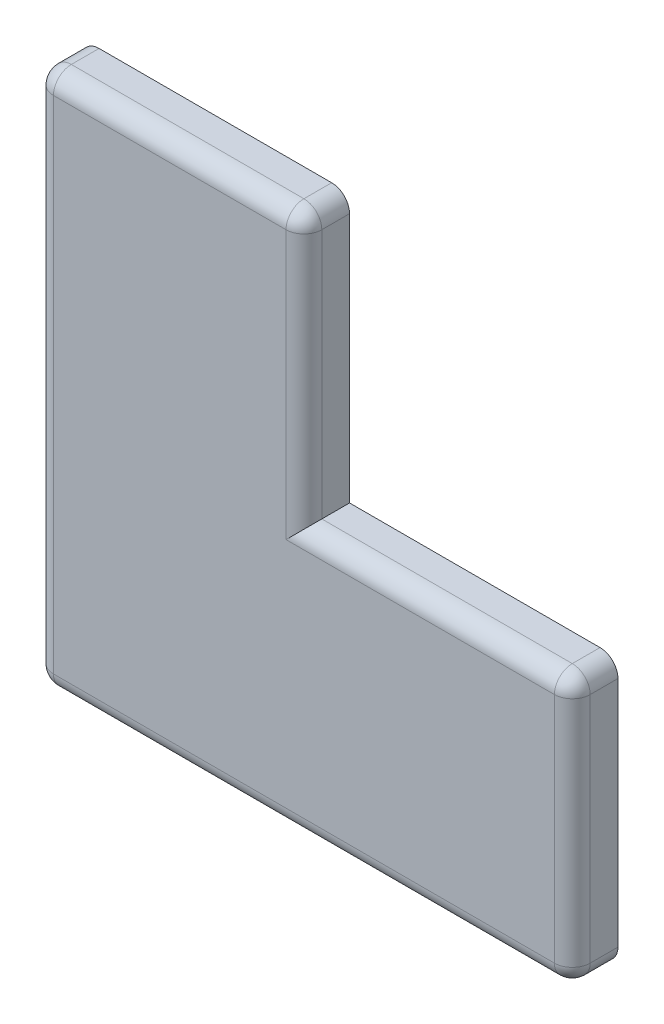
ISO-10303-21;
HEADER;
FILE_DESCRIPTION(('STEP AP214'),'2;1');
FILE_NAME('part.step','',(''),(''),'','','');
FILE_SCHEMA(('AUTOMOTIVE_DESIGN { 1 0 10303 214 1 1 1 1 }'));
ENDSEC;
DATA;
#1=APPLICATION_CONTEXT('core data for automotive mechanical design processes');
#2=APPLICATION_PROTOCOL_DEFINITION('international standard','automotive_design',2000,#1);
#3=PRODUCT_CONTEXT('',#1,'mechanical');
#4=PRODUCT('Part','Part','',(#3));
#5=PRODUCT_RELATED_PRODUCT_CATEGORY('part','',(#4));
#6=PRODUCT_DEFINITION_FORMATION('','',#4);
#7=PRODUCT_DEFINITION_CONTEXT('part definition',#1,'design');
#8=PRODUCT_DEFINITION('design','',#6,#7);
#9=PRODUCT_DEFINITION_SHAPE('','',#8);
#10=(LENGTH_UNIT() NAMED_UNIT(*) SI_UNIT(.MILLI.,.METRE.));
#11=(NAMED_UNIT(*) PLANE_ANGLE_UNIT() SI_UNIT($,.RADIAN.));
#12=(NAMED_UNIT(*) SI_UNIT($,.STERADIAN.) SOLID_ANGLE_UNIT());
#13=UNCERTAINTY_MEASURE_WITH_UNIT(LENGTH_MEASURE(1.E-05),#10,'distance_accuracy_value','');
#14=(GEOMETRIC_REPRESENTATION_CONTEXT(3) GLOBAL_UNCERTAINTY_ASSIGNED_CONTEXT((#13)) GLOBAL_UNIT_ASSIGNED_CONTEXT((#10,
#11,#12)) REPRESENTATION_CONTEXT('',''));
#15=CARTESIAN_POINT('',(0.,0.,0.));
#16=DIRECTION('',(0.,0.,1.));
#17=DIRECTION('',(1.,0.,0.));
#18=AXIS2_PLACEMENT_3D('',#15,#16,#17);
#19=CARTESIAN_POINT('',(0.,0.,5.1));
#20=DIRECTION('',(0.,1.,0.));
#21=DIRECTION('',(0.,0.,1.));
#22=AXIS2_PLACEMENT_3D('',#19,#20,#21);
#23=PLANE('',#22);
#24=DIRECTION('',(1.,0.,0.));
#25=VECTOR('',#24,1.);
#26=CARTESIAN_POINT('',(0.,0.,3.1));
#27=LINE('',#26,#25);
#28=CARTESIAN_POINT('',(58.,0.,3.1));
#29=VERTEX_POINT('',#28);
#30=CARTESIAN_POINT('',(2.,0.,3.1));
#31=VERTEX_POINT('',#30);
#32=EDGE_CURVE('E33',#29,#31,#27,.F.);
#33=ORIENTED_EDGE('',*,*,#32,.T.);
#34=DIRECTION('',(0.,0.,-1.));
#35=VECTOR('',#34,1.);
#36=CARTESIAN_POINT('',(2.,0.,5.1));
#37=LINE('',#36,#35);
#38=CARTESIAN_POINT('',(2.,0.,0.));
#39=VERTEX_POINT('',#38);
#40=EDGE_CURVE('E286',#31,#39,#37,.T.);
#41=ORIENTED_EDGE('',*,*,#40,.T.);
#42=DIRECTION('',(1.,0.,0.));
#43=VECTOR('',#42,1.);
#44=CARTESIAN_POINT('',(0.,0.,0.));
#45=LINE('',#44,#43);
#46=CARTESIAN_POINT('',(58.,0.,0.));
#47=VERTEX_POINT('',#46);
#48=EDGE_CURVE('E209',#39,#47,#45,.T.);
#49=ORIENTED_EDGE('',*,*,#48,.T.);
#50=DIRECTION('',(0.,0.,-1.));
#51=VECTOR('',#50,1.);
#52=CARTESIAN_POINT('',(58.,0.,5.1));
#53=LINE('',#52,#51);
#54=EDGE_CURVE('E38',#47,#29,#53,.F.);
#55=ORIENTED_EDGE('',*,*,#54,.T.);
#56=EDGE_LOOP('',(#33,#41,#49,#55));
#57=FACE_BOUND('',#56,.T.);
#58=ADVANCED_FACE('F16',(#57),#23,.F.);
#59=CARTESIAN_POINT('',(60.,0.,5.1));
#60=DIRECTION('',(-1.,0.,0.));
#61=DIRECTION('',(0.,0.,1.));
#62=AXIS2_PLACEMENT_3D('',#59,#60,#61);
#63=PLANE('',#62);
#64=DIRECTION('',(0.,1.,0.));
#65=VECTOR('',#64,1.);
#66=CARTESIAN_POINT('',(60.,0.,3.1));
#67=LINE('',#66,#65);
#68=CARTESIAN_POINT('',(60.,28.,3.1));
#69=VERTEX_POINT('',#68);
#70=CARTESIAN_POINT('',(60.,2.,3.1));
#71=VERTEX_POINT('',#70);
#72=EDGE_CURVE('E280',#69,#71,#67,.F.);
#73=ORIENTED_EDGE('',*,*,#72,.T.);
#74=DIRECTION('',(0.,0.,-1.));
#75=VECTOR('',#74,1.);
#76=CARTESIAN_POINT('',(60.,2.,5.1));
#77=LINE('',#76,#75);
#78=CARTESIAN_POINT('',(60.,2.,0.));
#79=VERTEX_POINT('',#78);
#80=EDGE_CURVE('E282',#71,#79,#77,.T.);
#81=ORIENTED_EDGE('',*,*,#80,.T.);
#82=DIRECTION('',(0.,1.,0.));
#83=VECTOR('',#82,1.);
#84=CARTESIAN_POINT('',(60.,0.,0.));
#85=LINE('',#84,#83);
#86=CARTESIAN_POINT('',(60.,28.,0.));
#87=VERTEX_POINT('',#86);
#88=EDGE_CURVE('E218',#79,#87,#85,.T.);
#89=ORIENTED_EDGE('',*,*,#88,.T.);
#90=DIRECTION('',(0.,0.,-1.));
#91=VECTOR('',#90,1.);
#92=CARTESIAN_POINT('',(60.,28.,5.1));
#93=LINE('',#92,#91);
#94=EDGE_CURVE('E278',#87,#69,#93,.F.);
#95=ORIENTED_EDGE('',*,*,#94,.T.);
#96=EDGE_LOOP('',(#73,#81,#89,#95));
#97=FACE_BOUND('',#96,.T.);
#98=ADVANCED_FACE('F399',(#97),#63,.F.);
#99=CARTESIAN_POINT('',(60.,30.,5.1));
#100=DIRECTION('',(0.,-1.,0.));
#101=DIRECTION('',(1.,0.,0.));
#102=AXIS2_PLACEMENT_3D('',#99,#100,#101);
#103=PLANE('',#102);
#104=DIRECTION('',(0.,0.,-1.));
#105=VECTOR('',#104,1.);
#106=CARTESIAN_POINT('',(30.,30.,5.1));
#107=LINE('',#106,#105);
#108=CARTESIAN_POINT('',(30.,30.,3.1));
#109=VERTEX_POINT('',#108);
#110=CARTESIAN_POINT('',(30.,30.,0.));
#111=VERTEX_POINT('',#110);
#112=EDGE_CURVE('E232',#109,#111,#107,.T.);
#113=ORIENTED_EDGE('',*,*,#112,.F.);
#114=DIRECTION('',(-1.,0.,0.));
#115=VECTOR('',#114,1.);
#116=CARTESIAN_POINT('',(60.,30.,3.1));
#117=LINE('',#116,#115);
#118=CARTESIAN_POINT('',(58.,30.,3.1));
#119=VERTEX_POINT('',#118);
#120=EDGE_CURVE('E276',#109,#119,#117,.F.);
#121=ORIENTED_EDGE('',*,*,#120,.T.);
#122=DIRECTION('',(0.,0.,-1.));
#123=VECTOR('',#122,1.);
#124=CARTESIAN_POINT('',(58.,30.,5.1));
#125=LINE('',#124,#123);
#126=CARTESIAN_POINT('',(58.,30.,0.));
#127=VERTEX_POINT('',#126);
#128=EDGE_CURVE('E274',#119,#127,#125,.T.);
#129=ORIENTED_EDGE('',*,*,#128,.T.);
#130=DIRECTION('',(-1.,0.,0.));
#131=VECTOR('',#130,1.);
#132=CARTESIAN_POINT('',(60.,30.,0.));
#133=LINE('',#132,#131);
#134=EDGE_CURVE('E221',#127,#111,#133,.T.);
#135=ORIENTED_EDGE('',*,*,#134,.T.);
#136=EDGE_LOOP('',(#113,#121,#129,#135));
#137=FACE_BOUND('',#136,.T.);
#138=ADVANCED_FACE('F404',(#137),#103,.F.);
#139=CARTESIAN_POINT('',(30.,30.,5.1));
#140=DIRECTION('',(-1.,0.,0.));
#141=DIRECTION('',(0.,0.,1.));
#142=AXIS2_PLACEMENT_3D('',#139,#140,#141);
#143=PLANE('',#142);
#144=DIRECTION('',(0.,0.,-1.));
#145=VECTOR('',#144,1.);
#146=CARTESIAN_POINT('',(30.,58.,5.1));
#147=LINE('',#146,#145);
#148=CARTESIAN_POINT('',(30.,58.,0.));
#149=VERTEX_POINT('',#148);
#150=CARTESIAN_POINT('',(30.,58.,3.1));
#151=VERTEX_POINT('',#150);
#152=EDGE_CURVE('E270',#149,#151,#147,.F.);
#153=ORIENTED_EDGE('',*,*,#152,.T.);
#154=DIRECTION('',(0.,1.,0.));
#155=VECTOR('',#154,1.);
#156=CARTESIAN_POINT('',(30.,30.,3.1));
#157=LINE('',#156,#155);
#158=EDGE_CURVE('E272',#151,#109,#157,.F.);
#159=ORIENTED_EDGE('',*,*,#158,.T.);
#160=ORIENTED_EDGE('',*,*,#112,.T.);
#161=DIRECTION('',(0.,1.,0.));
#162=VECTOR('',#161,1.);
#163=CARTESIAN_POINT('',(30.,30.,0.));
#164=LINE('',#163,#162);
#165=EDGE_CURVE('E223',#111,#149,#164,.T.);
#166=ORIENTED_EDGE('',*,*,#165,.T.);
#167=EDGE_LOOP('',(#153,#159,#160,#166));
#168=FACE_BOUND('',#167,.T.);
#169=ADVANCED_FACE('F514',(#168),#143,.F.);
#170=CARTESIAN_POINT('',(30.,60.,5.1));
#171=DIRECTION('',(0.,-1.,0.));
#172=DIRECTION('',(1.,0.,0.));
#173=AXIS2_PLACEMENT_3D('',#170,#171,#172);
#174=PLANE('',#173);
#175=DIRECTION('',(-1.,0.,0.));
#176=VECTOR('',#175,1.);
#177=CARTESIAN_POINT('',(30.,60.,0.));
#178=LINE('',#177,#176);
#179=CARTESIAN_POINT('',(28.,60.,0.));
#180=VERTEX_POINT('',#179);
#181=CARTESIAN_POINT('',(2.,60.,0.));
#182=VERTEX_POINT('',#181);
#183=EDGE_CURVE('E226',#180,#182,#178,.T.);
#184=ORIENTED_EDGE('',*,*,#183,.T.);
#185=DIRECTION('',(0.,0.,-1.));
#186=VECTOR('',#185,1.);
#187=CARTESIAN_POINT('',(2.,60.,5.1));
#188=LINE('',#187,#186);
#189=CARTESIAN_POINT('',(2.,60.,3.1));
#190=VERTEX_POINT('',#189);
#191=EDGE_CURVE('E268',#182,#190,#188,.F.);
#192=ORIENTED_EDGE('',*,*,#191,.T.);
#193=DIRECTION('',(-1.,0.,0.));
#194=VECTOR('',#193,1.);
#195=CARTESIAN_POINT('',(30.,60.,3.1));
#196=LINE('',#195,#194);
#197=CARTESIAN_POINT('',(28.,60.,3.1));
#198=VERTEX_POINT('',#197);
#199=EDGE_CURVE('E266',#190,#198,#196,.F.);
#200=ORIENTED_EDGE('',*,*,#199,.T.);
#201=DIRECTION('',(0.,0.,-1.));
#202=VECTOR('',#201,1.);
#203=CARTESIAN_POINT('',(28.,60.,5.1));
#204=LINE('',#203,#202);
#205=EDGE_CURVE('E264',#198,#180,#204,.T.);
#206=ORIENTED_EDGE('',*,*,#205,.T.);
#207=EDGE_LOOP('',(#184,#192,#200,#206));
#208=FACE_BOUND('',#207,.T.);
#209=ADVANCED_FACE('F503',(#208),#174,.F.);
#210=CARTESIAN_POINT('',(0.,0.,5.1));
#211=DIRECTION('',(1.,0.,0.));
#212=DIRECTION('',(0.,0.,-1.));
#213=AXIS2_PLACEMENT_3D('',#210,#211,#212);
#214=PLANE('',#213);
#215=DIRECTION('',(0.,-1.,0.));
#216=VECTOR('',#215,1.);
#217=CARTESIAN_POINT('',(0.,0.,0.));
#218=LINE('',#217,#216);
#219=CARTESIAN_POINT('',(0.,58.,0.));
#220=VERTEX_POINT('',#219);
#221=CARTESIAN_POINT('',(0.,2.,0.));
#222=VERTEX_POINT('',#221);
#223=EDGE_CURVE('E229',#220,#222,#218,.T.);
#224=ORIENTED_EDGE('',*,*,#223,.T.);
#225=DIRECTION('',(0.,0.,-1.));
#226=VECTOR('',#225,1.);
#227=CARTESIAN_POINT('',(0.,2.,5.1));
#228=LINE('',#227,#226);
#229=CARTESIAN_POINT('',(0.,2.,3.1));
#230=VERTEX_POINT('',#229);
#231=EDGE_CURVE('E262',#222,#230,#228,.F.);
#232=ORIENTED_EDGE('',*,*,#231,.T.);
#233=DIRECTION('',(0.,-1.,0.));
#234=VECTOR('',#233,1.);
#235=CARTESIAN_POINT('',(0.,60.,3.1));
#236=LINE('',#235,#234);
#237=CARTESIAN_POINT('',(0.,58.,3.1));
#238=VERTEX_POINT('',#237);
#239=EDGE_CURVE('E259',#230,#238,#236,.F.);
#240=ORIENTED_EDGE('',*,*,#239,.T.);
#241=DIRECTION('',(0.,0.,-1.));
#242=VECTOR('',#241,1.);
#243=CARTESIAN_POINT('',(0.,58.,5.1));
#244=LINE('',#243,#242);
#245=EDGE_CURVE('E257',#238,#220,#244,.T.);
#246=ORIENTED_EDGE('',*,*,#245,.T.);
#247=EDGE_LOOP('',(#224,#232,#240,#246));
#248=FACE_BOUND('',#247,.T.);
#249=ADVANCED_FACE('F491',(#248),#214,.F.);
#250=CARTESIAN_POINT('',(0.,0.,5.1));
#251=DIRECTION('',(0.,0.,1.));
#252=DIRECTION('',(1.,0.,0.));
#253=AXIS2_PLACEMENT_3D('',#250,#251,#252);
#254=PLANE('',#253);
#255=DIRECTION('',(-1.,0.,0.));
#256=VECTOR('',#255,1.);
#257=CARTESIAN_POINT('',(0.,58.,5.1));
#258=LINE('',#257,#256);
#259=CARTESIAN_POINT('',(28.,58.,5.1));
#260=VERTEX_POINT('',#259);
#261=CARTESIAN_POINT('',(2.,58.,5.1));
#262=VERTEX_POINT('',#261);
#263=EDGE_CURVE('E252',#260,#262,#258,.T.);
#264=ORIENTED_EDGE('',*,*,#263,.T.);
#265=DIRECTION('',(0.,-1.,0.));
#266=VECTOR('',#265,1.);
#267=CARTESIAN_POINT('',(2.,0.,5.1));
#268=LINE('',#267,#266);
#269=CARTESIAN_POINT('',(2.,2.,5.1));
#270=VERTEX_POINT('',#269);
#271=EDGE_CURVE('E254',#262,#270,#268,.T.);
#272=ORIENTED_EDGE('',*,*,#271,.T.);
#273=DIRECTION('',(1.,0.,0.));
#274=VECTOR('',#273,1.);
#275=CARTESIAN_POINT('',(60.,2.,5.1));
#276=LINE('',#275,#274);
#277=CARTESIAN_POINT('',(58.,2.,5.1));
#278=VERTEX_POINT('',#277);
#279=EDGE_CURVE('E244',#270,#278,#276,.T.);
#280=ORIENTED_EDGE('',*,*,#279,.T.);
#281=DIRECTION('',(0.,1.,0.));
#282=VECTOR('',#281,1.);
#283=CARTESIAN_POINT('',(58.,30.,5.1));
#284=LINE('',#283,#282);
#285=CARTESIAN_POINT('',(58.,28.,5.1));
#286=VERTEX_POINT('',#285);
#287=EDGE_CURVE('E246',#278,#286,#284,.T.);
#288=ORIENTED_EDGE('',*,*,#287,.T.);
#289=DIRECTION('',(-1.,0.,0.));
#290=VECTOR('',#289,1.);
#291=CARTESIAN_POINT('',(30.,28.,5.1));
#292=LINE('',#291,#290);
#293=CARTESIAN_POINT('',(28.,28.,5.1));
#294=VERTEX_POINT('',#293);
#295=EDGE_CURVE('E248',#286,#294,#292,.T.);
#296=ORIENTED_EDGE('',*,*,#295,.T.);
#297=DIRECTION('',(0.,1.,0.));
#298=VECTOR('',#297,1.);
#299=CARTESIAN_POINT('',(28.,60.,5.1));
#300=LINE('',#299,#298);
#301=EDGE_CURVE('E250',#294,#260,#300,.T.);
#302=ORIENTED_EDGE('',*,*,#301,.T.);
#303=EDGE_LOOP('',(#264,#272,#280,#288,#296,#302));
#304=FACE_BOUND('',#303,.T.);
#305=ADVANCED_FACE('F475',(#304),#254,.T.);
#306=CARTESIAN_POINT('',(0.,0.,0.));
#307=DIRECTION('',(0.,0.,1.));
#308=DIRECTION('',(1.,0.,0.));
#309=AXIS2_PLACEMENT_3D('',#306,#307,#308);
#310=PLANE('',#309);
#311=DIRECTION('',(-1.,0.,0.));
#312=VECTOR('',#311,1.);
#313=CARTESIAN_POINT('',(58.,2.,0.));
#314=LINE('',#313,#312);
#315=CARTESIAN_POINT('',(58.,2.,0.));
#316=VERTEX_POINT('',#315);
#317=CARTESIAN_POINT('',(2.,2.,0.));
#318=VERTEX_POINT('',#317);
#319=EDGE_CURVE('E196',#316,#318,#314,.T.);
#320=ORIENTED_EDGE('',*,*,#319,.F.);
#321=DIRECTION('',(0.,-1.,0.));
#322=VECTOR('',#321,1.);
#323=CARTESIAN_POINT('',(58.,28.,0.));
#324=LINE('',#323,#322);
#325=CARTESIAN_POINT('',(58.,28.,0.));
#326=VERTEX_POINT('',#325);
#327=EDGE_CURVE('E161',#326,#316,#324,.T.);
#328=ORIENTED_EDGE('',*,*,#327,.F.);
#329=DIRECTION('',(1.,0.,0.));
#330=VECTOR('',#329,1.);
#331=CARTESIAN_POINT('',(28.,28.,0.));
#332=LINE('',#331,#330);
#333=CARTESIAN_POINT('',(28.,28.,0.));
#334=VERTEX_POINT('',#333);
#335=EDGE_CURVE('E179',#334,#326,#332,.T.);
#336=ORIENTED_EDGE('',*,*,#335,.F.);
#337=DIRECTION('',(0.,-1.,0.));
#338=VECTOR('',#337,1.);
#339=CARTESIAN_POINT('',(28.,58.,0.));
#340=LINE('',#339,#338);
#341=CARTESIAN_POINT('',(28.,58.,0.));
#342=VERTEX_POINT('',#341);
#343=EDGE_CURVE('E182',#342,#334,#340,.T.);
#344=ORIENTED_EDGE('',*,*,#343,.F.);
#345=DIRECTION('',(1.,0.,0.));
#346=VECTOR('',#345,1.);
#347=CARTESIAN_POINT('',(2.,58.,0.));
#348=LINE('',#347,#346);
#349=CARTESIAN_POINT('',(2.,58.,0.));
#350=VERTEX_POINT('',#349);
#351=EDGE_CURVE('E202',#350,#342,#348,.T.);
#352=ORIENTED_EDGE('',*,*,#351,.F.);
#353=DIRECTION('',(0.,1.,0.));
#354=VECTOR('',#353,1.);
#355=CARTESIAN_POINT('',(2.,2.,0.));
#356=LINE('',#355,#354);
#357=EDGE_CURVE('E199',#318,#350,#356,.T.);
#358=ORIENTED_EDGE('',*,*,#357,.F.);
#359=EDGE_LOOP('',(#320,#328,#336,#344,#352,#358));
#360=FACE_BOUND('',#359,.T.);
#361=ORIENTED_EDGE('',*,*,#48,.F.);
#362=CARTESIAN_POINT('',(2.,2.,0.));
#363=DIRECTION('',(0.,0.,1.));
#364=DIRECTION('',(1.,0.,0.));
#365=AXIS2_PLACEMENT_3D('',#362,#363,#364);
#366=CIRCLE('',#365,2.);
#367=EDGE_CURVE('E10',#39,#222,#366,.F.);
#368=ORIENTED_EDGE('',*,*,#367,.T.);
#369=ORIENTED_EDGE('',*,*,#223,.F.);
#370=CARTESIAN_POINT('',(2.,58.,0.));
#371=DIRECTION('',(0.,0.,1.));
#372=DIRECTION('',(1.,0.,0.));
#373=AXIS2_PLACEMENT_3D('',#370,#371,#372);
#374=CIRCLE('',#373,2.);
#375=EDGE_CURVE('E290',#220,#182,#374,.F.);
#376=ORIENTED_EDGE('',*,*,#375,.T.);
#377=ORIENTED_EDGE('',*,*,#183,.F.);
#378=CARTESIAN_POINT('',(28.,58.,0.));
#379=DIRECTION('',(0.,0.,1.));
#380=DIRECTION('',(1.,0.,0.));
#381=AXIS2_PLACEMENT_3D('',#378,#379,#380);
#382=CIRCLE('',#381,2.);
#383=EDGE_CURVE('E288',#180,#149,#382,.F.);
#384=ORIENTED_EDGE('',*,*,#383,.T.);
#385=ORIENTED_EDGE('',*,*,#165,.F.);
#386=ORIENTED_EDGE('',*,*,#134,.F.);
#387=CARTESIAN_POINT('',(58.,28.,0.));
#388=DIRECTION('',(0.,0.,1.));
#389=DIRECTION('',(1.,0.,0.));
#390=AXIS2_PLACEMENT_3D('',#387,#388,#389);
#391=CIRCLE('',#390,2.);
#392=EDGE_CURVE('E292',#127,#87,#391,.F.);
#393=ORIENTED_EDGE('',*,*,#392,.T.);
#394=ORIENTED_EDGE('',*,*,#88,.F.);
#395=CARTESIAN_POINT('',(58.,2.,0.));
#396=DIRECTION('',(0.,0.,1.));
#397=DIRECTION('',(1.,0.,0.));
#398=AXIS2_PLACEMENT_3D('',#395,#396,#397);
#399=CIRCLE('',#398,2.);
#400=EDGE_CURVE('E25',#79,#47,#399,.F.);
#401=ORIENTED_EDGE('',*,*,#400,.T.);
#402=EDGE_LOOP('',(#361,#368,#369,#376,#377,#384,#385,#386,#393,#394,#401));
#403=FACE_BOUND('',#402,.T.);
#404=ADVANCED_FACE('F497',(#360,#403),#310,.F.);
#405=CARTESIAN_POINT('',(58.,28.,1.75));
#406=DIRECTION('',(1.,0.,0.));
#407=DIRECTION('',(0.,0.,-1.));
#408=AXIS2_PLACEMENT_3D('',#405,#406,#407);
#409=PLANE('',#408);
#410=ORIENTED_EDGE('',*,*,#327,.T.);
#411=DIRECTION('',(0.,0.,-1.));
#412=VECTOR('',#411,1.);
#413=CARTESIAN_POINT('',(58.,2.,1.75));
#414=LINE('',#413,#412);
#415=CARTESIAN_POINT('',(58.,2.,1.75));
#416=VERTEX_POINT('',#415);
#417=EDGE_CURVE('E154',#416,#316,#414,.T.);
#418=ORIENTED_EDGE('',*,*,#417,.F.);
#419=DIRECTION('',(0.,-1.,0.));
#420=VECTOR('',#419,1.);
#421=CARTESIAN_POINT('',(58.,28.,1.75));
#422=LINE('',#421,#420);
#423=CARTESIAN_POINT('',(58.,28.,1.75));
#424=VERTEX_POINT('',#423);
#425=EDGE_CURVE('E158',#424,#416,#422,.T.);
#426=ORIENTED_EDGE('',*,*,#425,.F.);
#427=DIRECTION('',(0.,0.,-1.));
#428=VECTOR('',#427,1.);
#429=CARTESIAN_POINT('',(58.,28.,1.75));
#430=LINE('',#429,#428);
#431=EDGE_CURVE('E207',#424,#326,#430,.T.);
#432=ORIENTED_EDGE('',*,*,#431,.T.);
#433=EDGE_LOOP('',(#410,#418,#426,#432));
#434=FACE_BOUND('',#433,.T.);
#435=ADVANCED_FACE('F156',(#434),#409,.F.);
#436=CARTESIAN_POINT('',(28.,28.,1.75));
#437=DIRECTION('',(0.,1.,0.));
#438=DIRECTION('',(-1.,0.,0.));
#439=AXIS2_PLACEMENT_3D('',#436,#437,#438);
#440=PLANE('',#439);
#441=ORIENTED_EDGE('',*,*,#335,.T.);
#442=ORIENTED_EDGE('',*,*,#431,.F.);
#443=DIRECTION('',(1.,0.,0.));
#444=VECTOR('',#443,1.);
#445=CARTESIAN_POINT('',(28.,28.,1.75));
#446=LINE('',#445,#444);
#447=CARTESIAN_POINT('',(28.,28.,1.75));
#448=VERTEX_POINT('',#447);
#449=EDGE_CURVE('E166',#448,#424,#446,.T.);
#450=ORIENTED_EDGE('',*,*,#449,.F.);
#451=DIRECTION('',(0.,0.,-1.));
#452=VECTOR('',#451,1.);
#453=CARTESIAN_POINT('',(28.,28.,1.75));
#454=LINE('',#453,#452);
#455=EDGE_CURVE('E210',#448,#334,#454,.T.);
#456=ORIENTED_EDGE('',*,*,#455,.T.);
#457=EDGE_LOOP('',(#441,#442,#450,#456));
#458=FACE_BOUND('',#457,.T.);
#459=ADVANCED_FACE('F540',(#458),#440,.F.);
#460=CARTESIAN_POINT('',(28.,58.,1.75));
#461=DIRECTION('',(1.,0.,0.));
#462=DIRECTION('',(0.,0.,-1.));
#463=AXIS2_PLACEMENT_3D('',#460,#461,#462);
#464=PLANE('',#463);
#465=ORIENTED_EDGE('',*,*,#343,.T.);
#466=ORIENTED_EDGE('',*,*,#455,.F.);
#467=DIRECTION('',(0.,-1.,0.));
#468=VECTOR('',#467,1.);
#469=CARTESIAN_POINT('',(28.,58.,1.75));
#470=LINE('',#469,#468);
#471=CARTESIAN_POINT('',(28.,58.,1.75));
#472=VERTEX_POINT('',#471);
#473=EDGE_CURVE('E192',#472,#448,#470,.T.);
#474=ORIENTED_EDGE('',*,*,#473,.F.);
#475=DIRECTION('',(0.,0.,-1.));
#476=VECTOR('',#475,1.);
#477=CARTESIAN_POINT('',(28.,58.,1.75));
#478=LINE('',#477,#476);
#479=EDGE_CURVE('E212',#472,#342,#478,.T.);
#480=ORIENTED_EDGE('',*,*,#479,.T.);
#481=EDGE_LOOP('',(#465,#466,#474,#480));
#482=FACE_BOUND('',#481,.T.);
#483=ADVANCED_FACE('F548',(#482),#464,.F.);
#484=CARTESIAN_POINT('',(2.,58.,1.75));
#485=DIRECTION('',(0.,1.,0.));
#486=DIRECTION('',(-1.,0.,0.));
#487=AXIS2_PLACEMENT_3D('',#484,#485,#486);
#488=PLANE('',#487);
#489=ORIENTED_EDGE('',*,*,#351,.T.);
#490=ORIENTED_EDGE('',*,*,#479,.F.);
#491=DIRECTION('',(1.,0.,0.));
#492=VECTOR('',#491,1.);
#493=CARTESIAN_POINT('',(2.,58.,1.75));
#494=LINE('',#493,#492);
#495=CARTESIAN_POINT('',(2.,58.,1.75));
#496=VERTEX_POINT('',#495);
#497=EDGE_CURVE('E189',#496,#472,#494,.T.);
#498=ORIENTED_EDGE('',*,*,#497,.F.);
#499=DIRECTION('',(0.,0.,-1.));
#500=VECTOR('',#499,1.);
#501=CARTESIAN_POINT('',(2.,58.,1.75));
#502=LINE('',#501,#500);
#503=EDGE_CURVE('E214',#496,#350,#502,.T.);
#504=ORIENTED_EDGE('',*,*,#503,.T.);
#505=EDGE_LOOP('',(#489,#490,#498,#504));
#506=FACE_BOUND('',#505,.T.);
#507=ADVANCED_FACE('F544',(#506),#488,.F.);
#508=CARTESIAN_POINT('',(2.,2.,1.75));
#509=DIRECTION('',(-1.,0.,0.));
#510=DIRECTION('',(0.,0.,1.));
#511=AXIS2_PLACEMENT_3D('',#508,#509,#510);
#512=PLANE('',#511);
#513=ORIENTED_EDGE('',*,*,#357,.T.);
#514=ORIENTED_EDGE('',*,*,#503,.F.);
#515=DIRECTION('',(0.,1.,0.));
#516=VECTOR('',#515,1.);
#517=CARTESIAN_POINT('',(2.,2.,1.75));
#518=LINE('',#517,#516);
#519=CARTESIAN_POINT('',(2.,2.,1.75));
#520=VERTEX_POINT('',#519);
#521=EDGE_CURVE('E174',#520,#496,#518,.T.);
#522=ORIENTED_EDGE('',*,*,#521,.F.);
#523=DIRECTION('',(0.,0.,-1.));
#524=VECTOR('',#523,1.);
#525=CARTESIAN_POINT('',(2.,2.,1.75));
#526=LINE('',#525,#524);
#527=EDGE_CURVE('E165',#520,#318,#526,.T.);
#528=ORIENTED_EDGE('',*,*,#527,.T.);
#529=EDGE_LOOP('',(#513,#514,#522,#528));
#530=FACE_BOUND('',#529,.T.);
#531=ADVANCED_FACE('F384',(#530),#512,.F.);
#532=CARTESIAN_POINT('',(58.,2.,1.75));
#533=DIRECTION('',(0.,-1.,0.));
#534=DIRECTION('',(0.,0.,-1.));
#535=AXIS2_PLACEMENT_3D('',#532,#533,#534);
#536=PLANE('',#535);
#537=ORIENTED_EDGE('',*,*,#319,.T.);
#538=ORIENTED_EDGE('',*,*,#527,.F.);
#539=DIRECTION('',(-1.,0.,0.));
#540=VECTOR('',#539,1.);
#541=CARTESIAN_POINT('',(58.,2.,1.75));
#542=LINE('',#541,#540);
#543=EDGE_CURVE('E169',#416,#520,#542,.T.);
#544=ORIENTED_EDGE('',*,*,#543,.F.);
#545=ORIENTED_EDGE('',*,*,#417,.T.);
#546=EDGE_LOOP('',(#537,#538,#544,#545));
#547=FACE_BOUND('',#546,.T.);
#548=ADVANCED_FACE('F170',(#547),#536,.F.);
#549=CARTESIAN_POINT('',(0.,0.,1.75));
#550=DIRECTION('',(0.,0.,-1.));
#551=DIRECTION('',(-1.,0.,0.));
#552=AXIS2_PLACEMENT_3D('',#549,#550,#551);
#553=PLANE('',#552);
#554=CARTESIAN_POINT('',(15.,45.,1.75));
#555=DIRECTION('',(0.,0.,-1.));
#556=DIRECTION('',(-1.,0.,0.));
#557=AXIS2_PLACEMENT_3D('',#554,#555,#556);
#558=CIRCLE('',#557,5.);
#559=CARTESIAN_POINT('',(9.99999999999999,45.,1.75));
#560=VERTEX_POINT('',#559);
#561=EDGE_CURVE('E343',#560,#560,#558,.T.);
#562=ORIENTED_EDGE('',*,*,#561,.F.);
#563=EDGE_LOOP('',(#562));
#564=FACE_BOUND('',#563,.T.);
#565=CARTESIAN_POINT('',(15.,15.,1.75));
#566=DIRECTION('',(0.,0.,-1.));
#567=DIRECTION('',(-1.,0.,0.));
#568=AXIS2_PLACEMENT_3D('',#565,#566,#567);
#569=CIRCLE('',#568,5.);
#570=CARTESIAN_POINT('',(10.,15.,1.75));
#571=VERTEX_POINT('',#570);
#572=EDGE_CURVE('E356',#571,#571,#569,.T.);
#573=ORIENTED_EDGE('',*,*,#572,.F.);
#574=EDGE_LOOP('',(#573));
#575=FACE_BOUND('',#574,.T.);
#576=CARTESIAN_POINT('',(45.,15.,1.75));
#577=DIRECTION('',(0.,0.,-1.));
#578=DIRECTION('',(-1.,0.,0.));
#579=AXIS2_PLACEMENT_3D('',#576,#577,#578);
#580=CIRCLE('',#579,5.);
#581=CARTESIAN_POINT('',(40.,15.,1.75));
#582=VERTEX_POINT('',#581);
#583=EDGE_CURVE('E185',#582,#582,#580,.T.);
#584=ORIENTED_EDGE('',*,*,#583,.F.);
#585=EDGE_LOOP('',(#584));
#586=FACE_BOUND('',#585,.T.);
#587=ORIENTED_EDGE('',*,*,#425,.T.);
#588=ORIENTED_EDGE('',*,*,#543,.T.);
#589=ORIENTED_EDGE('',*,*,#521,.T.);
#590=ORIENTED_EDGE('',*,*,#497,.T.);
#591=ORIENTED_EDGE('',*,*,#473,.T.);
#592=ORIENTED_EDGE('',*,*,#449,.T.);
#593=EDGE_LOOP('',(#587,#588,#589,#590,#591,#592));
#594=FACE_BOUND('',#593,.T.);
#595=ADVANCED_FACE('F176',(#564,#575,#586,#594),#553,.T.);
#596=CARTESIAN_POINT('',(45.,15.,-8.15));
#597=DIRECTION('',(0.,0.,-1.));
#598=DIRECTION('',(-1.,0.,0.));
#599=AXIS2_PLACEMENT_3D('',#596,#597,#598);
#600=PLANE('',#599);
#601=CARTESIAN_POINT('',(45.,15.,-8.15));
#602=DIRECTION('',(0.,0.,-1.));
#603=DIRECTION('',(-1.,0.,0.));
#604=AXIS2_PLACEMENT_3D('',#601,#602,#603);
#605=CIRCLE('',#604,5.);
#606=CARTESIAN_POINT('',(40.,15.,-8.15));
#607=VERTEX_POINT('',#606);
#608=EDGE_CURVE('E197',#607,#607,#605,.T.);
#609=ORIENTED_EDGE('',*,*,#608,.T.);
#610=EDGE_LOOP('',(#609));
#611=FACE_BOUND('',#610,.T.);
#612=CARTESIAN_POINT('',(45.,15.,-8.15));
#613=DIRECTION('',(0.,0.,-1.));
#614=DIRECTION('',(-1.,0.,0.));
#615=AXIS2_PLACEMENT_3D('',#612,#613,#614);
#616=CIRCLE('',#615,2.9);
#617=CARTESIAN_POINT('',(42.1,15.,-8.15));
#618=VERTEX_POINT('',#617);
#619=EDGE_CURVE('E360',#618,#618,#616,.T.);
#620=ORIENTED_EDGE('',*,*,#619,.F.);
#621=EDGE_LOOP('',(#620));
#622=FACE_BOUND('',#621,.T.);
#623=ADVANCED_FACE('F373',(#611,#622),#600,.T.);
#624=CARTESIAN_POINT('',(45.,15.,-8.15));
#625=DIRECTION('',(0.,0.,1.));
#626=DIRECTION('',(1.,0.,0.));
#627=AXIS2_PLACEMENT_3D('',#624,#625,#626);
#628=CYLINDRICAL_SURFACE('',#627,5.);
#629=ORIENTED_EDGE('',*,*,#608,.F.);
#630=EDGE_LOOP('',(#629));
#631=FACE_BOUND('',#630,.T.);
#632=ORIENTED_EDGE('',*,*,#583,.T.);
#633=EDGE_LOOP('',(#632));
#634=FACE_BOUND('',#633,.T.);
#635=ADVANCED_FACE('F370',(#631,#634),#628,.T.);
#636=CARTESIAN_POINT('',(45.,15.,-8.15));
#637=DIRECTION('',(0.,0.,1.));
#638=DIRECTION('',(1.,0.,0.));
#639=AXIS2_PLACEMENT_3D('',#636,#637,#638);
#640=CYLINDRICAL_SURFACE('',#639,2.9);
#641=ORIENTED_EDGE('',*,*,#619,.T.);
#642=EDGE_LOOP('',(#641));
#643=FACE_BOUND('',#642,.T.);
#644=CARTESIAN_POINT('',(45.,15.,1.75));
#645=DIRECTION('',(0.,0.,-1.));
#646=DIRECTION('',(-1.,0.,0.));
#647=AXIS2_PLACEMENT_3D('',#644,#645,#646);
#648=CIRCLE('',#647,2.9);
#649=CARTESIAN_POINT('',(42.1,15.,1.75));
#650=VERTEX_POINT('',#649);
#651=EDGE_CURVE('E235',#650,#650,#648,.F.);
#652=ORIENTED_EDGE('',*,*,#651,.T.);
#653=EDGE_LOOP('',(#652));
#654=FACE_BOUND('',#653,.T.);
#655=ADVANCED_FACE('F396',(#643,#654),#640,.F.);
#656=ORIENTED_EDGE('',*,*,#651,.F.);
#657=EDGE_LOOP('',(#656));
#658=FACE_BOUND('',#657,.T.);
#659=ADVANCED_FACE('F377',(#658),#553,.T.);
#660=CARTESIAN_POINT('',(15.,15.,-8.15));
#661=DIRECTION('',(0.,0.,-1.));
#662=DIRECTION('',(-1.,0.,0.));
#663=AXIS2_PLACEMENT_3D('',#660,#661,#662);
#664=PLANE('',#663);
#665=CARTESIAN_POINT('',(15.,15.,-8.15));
#666=DIRECTION('',(0.,0.,-1.));
#667=DIRECTION('',(-1.,0.,0.));
#668=AXIS2_PLACEMENT_3D('',#665,#666,#667);
#669=CIRCLE('',#668,5.);
#670=CARTESIAN_POINT('',(10.,15.,-8.15));
#671=VERTEX_POINT('',#670);
#672=EDGE_CURVE('E357',#671,#671,#669,.T.);
#673=ORIENTED_EDGE('',*,*,#672,.T.);
#674=EDGE_LOOP('',(#673));
#675=FACE_BOUND('',#674,.T.);
#676=CARTESIAN_POINT('',(15.,15.,-8.15));
#677=DIRECTION('',(0.,0.,-1.));
#678=DIRECTION('',(-1.,0.,0.));
#679=AXIS2_PLACEMENT_3D('',#676,#677,#678);
#680=CIRCLE('',#679,2.9);
#681=CARTESIAN_POINT('',(12.1,15.,-8.15));
#682=VERTEX_POINT('',#681);
#683=EDGE_CURVE('E352',#682,#682,#680,.T.);
#684=ORIENTED_EDGE('',*,*,#683,.F.);
#685=EDGE_LOOP('',(#684));
#686=FACE_BOUND('',#685,.T.);
#687=ADVANCED_FACE('F395',(#675,#686),#664,.T.);
#688=CARTESIAN_POINT('',(15.,15.,-8.15));
#689=DIRECTION('',(0.,0.,1.));
#690=DIRECTION('',(1.,0.,0.));
#691=AXIS2_PLACEMENT_3D('',#688,#689,#690);
#692=CYLINDRICAL_SURFACE('',#691,5.);
#693=ORIENTED_EDGE('',*,*,#672,.F.);
#694=EDGE_LOOP('',(#693));
#695=FACE_BOUND('',#694,.T.);
#696=ORIENTED_EDGE('',*,*,#572,.T.);
#697=EDGE_LOOP('',(#696));
#698=FACE_BOUND('',#697,.T.);
#699=ADVANCED_FACE('F632',(#695,#698),#692,.T.);
#700=CARTESIAN_POINT('',(15.,15.,-8.15));
#701=DIRECTION('',(0.,0.,1.));
#702=DIRECTION('',(1.,0.,0.));
#703=AXIS2_PLACEMENT_3D('',#700,#701,#702);
#704=CYLINDRICAL_SURFACE('',#703,2.9);
#705=ORIENTED_EDGE('',*,*,#683,.T.);
#706=EDGE_LOOP('',(#705));
#707=FACE_BOUND('',#706,.T.);
#708=CARTESIAN_POINT('',(15.,15.,1.75));
#709=DIRECTION('',(0.,0.,-1.));
#710=DIRECTION('',(-1.,0.,0.));
#711=AXIS2_PLACEMENT_3D('',#708,#709,#710);
#712=CIRCLE('',#711,2.9);
#713=CARTESIAN_POINT('',(12.1,15.,1.75));
#714=VERTEX_POINT('',#713);
#715=EDGE_CURVE('E238',#714,#714,#712,.F.);
#716=ORIENTED_EDGE('',*,*,#715,.T.);
#717=EDGE_LOOP('',(#716));
#718=FACE_BOUND('',#717,.T.);
#719=ADVANCED_FACE('F643',(#707,#718),#704,.F.);
#720=ORIENTED_EDGE('',*,*,#715,.F.);
#721=EDGE_LOOP('',(#720));
#722=FACE_BOUND('',#721,.T.);
#723=ADVANCED_FACE('F393',(#722),#553,.T.);
#724=CARTESIAN_POINT('',(15.,45.,-8.15));
#725=DIRECTION('',(0.,0.,-1.));
#726=DIRECTION('',(-1.,0.,0.));
#727=AXIS2_PLACEMENT_3D('',#724,#725,#726);
#728=PLANE('',#727);
#729=CARTESIAN_POINT('',(15.,45.,-8.15));
#730=DIRECTION('',(0.,0.,-1.));
#731=DIRECTION('',(-1.,0.,0.));
#732=AXIS2_PLACEMENT_3D('',#729,#730,#731);
#733=CIRCLE('',#732,5.);
#734=CARTESIAN_POINT('',(9.99999999999999,45.,-8.15));
#735=VERTEX_POINT('',#734);
#736=EDGE_CURVE('E348',#735,#735,#733,.T.);
#737=ORIENTED_EDGE('',*,*,#736,.T.);
#738=EDGE_LOOP('',(#737));
#739=FACE_BOUND('',#738,.T.);
#740=CARTESIAN_POINT('',(15.,45.,-8.15));
#741=DIRECTION('',(0.,0.,-1.));
#742=DIRECTION('',(-1.,0.,0.));
#743=AXIS2_PLACEMENT_3D('',#740,#741,#742);
#744=CIRCLE('',#743,2.9);
#745=CARTESIAN_POINT('',(12.1,45.,-8.15));
#746=VERTEX_POINT('',#745);
#747=EDGE_CURVE('E340',#746,#746,#744,.T.);
#748=ORIENTED_EDGE('',*,*,#747,.F.);
#749=EDGE_LOOP('',(#748));
#750=FACE_BOUND('',#749,.T.);
#751=ADVANCED_FACE('F664',(#739,#750),#728,.T.);
#752=CARTESIAN_POINT('',(15.,45.,-8.15));
#753=DIRECTION('',(0.,0.,1.));
#754=DIRECTION('',(1.,0.,0.));
#755=AXIS2_PLACEMENT_3D('',#752,#753,#754);
#756=CYLINDRICAL_SURFACE('',#755,5.);
#757=ORIENTED_EDGE('',*,*,#736,.F.);
#758=EDGE_LOOP('',(#757));
#759=FACE_BOUND('',#758,.T.);
#760=ORIENTED_EDGE('',*,*,#561,.T.);
#761=EDGE_LOOP('',(#760));
#762=FACE_BOUND('',#761,.T.);
#763=ADVANCED_FACE('F674',(#759,#762),#756,.T.);
#764=CARTESIAN_POINT('',(15.,45.,-8.15));
#765=DIRECTION('',(0.,0.,1.));
#766=DIRECTION('',(1.,0.,0.));
#767=AXIS2_PLACEMENT_3D('',#764,#765,#766);
#768=CYLINDRICAL_SURFACE('',#767,2.9);
#769=ORIENTED_EDGE('',*,*,#747,.T.);
#770=EDGE_LOOP('',(#769));
#771=FACE_BOUND('',#770,.T.);
#772=CARTESIAN_POINT('',(15.,45.,1.75));
#773=DIRECTION('',(0.,0.,-1.));
#774=DIRECTION('',(-1.,0.,0.));
#775=AXIS2_PLACEMENT_3D('',#772,#773,#774);
#776=CIRCLE('',#775,2.9);
#777=CARTESIAN_POINT('',(12.1,45.,1.75));
#778=VERTEX_POINT('',#777);
#779=EDGE_CURVE('E241',#778,#778,#776,.F.);
#780=ORIENTED_EDGE('',*,*,#779,.T.);
#781=EDGE_LOOP('',(#780));
#782=FACE_BOUND('',#781,.T.);
#783=ADVANCED_FACE('F391',(#771,#782),#768,.F.);
#784=ORIENTED_EDGE('',*,*,#779,.F.);
#785=EDGE_LOOP('',(#784));
#786=FACE_BOUND('',#785,.T.);
#787=ADVANCED_FACE('F376',(#786),#553,.T.);
#788=CARTESIAN_POINT('',(58.,28.,5.1));
#789=DIRECTION('',(0.,0.,-1.));
#790=DIRECTION('',(-1.,0.,0.));
#791=AXIS2_PLACEMENT_3D('',#788,#789,#790);
#792=CYLINDRICAL_SURFACE('',#791,2.);
#793=ORIENTED_EDGE('',*,*,#392,.F.);
#794=ORIENTED_EDGE('',*,*,#128,.F.);
#795=CARTESIAN_POINT('',(58.,28.,3.1));
#796=DIRECTION('',(0.,0.,1.));
#797=DIRECTION('',(1.,0.,0.));
#798=AXIS2_PLACEMENT_3D('',#795,#796,#797);
#799=CIRCLE('',#798,2.);
#800=EDGE_CURVE('E334',#69,#119,#799,.T.);
#801=ORIENTED_EDGE('',*,*,#800,.F.);
#802=ORIENTED_EDGE('',*,*,#94,.F.);
#803=EDGE_LOOP('',(#793,#794,#801,#802));
#804=FACE_BOUND('',#803,.T.);
#805=ADVANCED_FACE('F18',(#804),#792,.T.);
#806=CARTESIAN_POINT('',(0.,28.,3.1));
#807=DIRECTION('',(1.,0.,0.));
#808=DIRECTION('',(0.,1.,0.));
#809=AXIS2_PLACEMENT_3D('',#806,#807,#808);
#810=CYLINDRICAL_SURFACE('',#809,2.);
#811=CARTESIAN_POINT('',(58.,28.,3.1));
#812=DIRECTION('',(1.,0.,0.));
#813=DIRECTION('',(0.,0.,-1.));
#814=AXIS2_PLACEMENT_3D('',#811,#812,#813);
#815=CIRCLE('',#814,2.);
#816=EDGE_CURVE('E20',#119,#286,#815,.T.);
#817=ORIENTED_EDGE('',*,*,#816,.F.);
#818=ORIENTED_EDGE('',*,*,#120,.F.);
#819=CARTESIAN_POINT('',(28.,28.,3.1));
#820=DIRECTION('',(0.707106781186548,-0.707106781186547,0.));
#821=DIRECTION('',(-0.707106781186547,-0.707106781186548,0.));
#822=AXIS2_PLACEMENT_3D('',#819,#820,#821);
#823=ELLIPSE('',#822,2.82842712474619,2.);
#824=EDGE_CURVE('E332',#294,#109,#823,.F.);
#825=ORIENTED_EDGE('',*,*,#824,.F.);
#826=ORIENTED_EDGE('',*,*,#295,.F.);
#827=EDGE_LOOP('',(#817,#818,#825,#826));
#828=FACE_BOUND('',#827,.T.);
#829=ADVANCED_FACE('F463',(#828),#810,.T.);
#830=CARTESIAN_POINT('',(58.,28.,3.1));
#831=DIRECTION('',(0.,0.,1.));
#832=DIRECTION('',(1.,0.,0.));
#833=AXIS2_PLACEMENT_3D('',#830,#831,#832);
#834=SPHERICAL_SURFACE('',#833,2.);
#835=ORIENTED_EDGE('',*,*,#800,.T.);
#836=ORIENTED_EDGE('',*,*,#816,.T.);
#837=CARTESIAN_POINT('',(58.,28.,3.1));
#838=DIRECTION('',(0.,1.,0.));
#839=DIRECTION('',(0.,0.,1.));
#840=AXIS2_PLACEMENT_3D('',#837,#838,#839);
#841=CIRCLE('',#840,2.);
#842=EDGE_CURVE('E329',#69,#286,#841,.F.);
#843=ORIENTED_EDGE('',*,*,#842,.F.);
#844=EDGE_LOOP('',(#835,#836,#843));
#845=FACE_BOUND('',#844,.T.);
#846=ADVANCED_FACE('F460',(#845),#834,.T.);
#847=CARTESIAN_POINT('',(28.,58.,5.1));
#848=DIRECTION('',(0.,0.,-1.));
#849=DIRECTION('',(-1.,0.,0.));
#850=AXIS2_PLACEMENT_3D('',#847,#848,#849);
#851=CYLINDRICAL_SURFACE('',#850,2.);
#852=ORIENTED_EDGE('',*,*,#383,.F.);
#853=ORIENTED_EDGE('',*,*,#205,.F.);
#854=CARTESIAN_POINT('',(28.,58.,3.1));
#855=DIRECTION('',(0.,0.,1.));
#856=DIRECTION('',(1.,0.,0.));
#857=AXIS2_PLACEMENT_3D('',#854,#855,#856);
#858=CIRCLE('',#857,2.);
#859=EDGE_CURVE('E326',#151,#198,#858,.T.);
#860=ORIENTED_EDGE('',*,*,#859,.F.);
#861=ORIENTED_EDGE('',*,*,#152,.F.);
#862=EDGE_LOOP('',(#852,#853,#860,#861));
#863=FACE_BOUND('',#862,.T.);
#864=ADVANCED_FACE('F456',(#863),#851,.T.);
#865=CARTESIAN_POINT('',(28.,0.,3.1));
#866=DIRECTION('',(0.,-1.,0.));
#867=DIRECTION('',(0.,0.,-1.));
#868=AXIS2_PLACEMENT_3D('',#865,#866,#867);
#869=CYLINDRICAL_SURFACE('',#868,2.);
#870=ORIENTED_EDGE('',*,*,#824,.T.);
#871=ORIENTED_EDGE('',*,*,#158,.F.);
#872=CARTESIAN_POINT('',(28.,58.,3.1));
#873=DIRECTION('',(0.,1.,0.));
#874=DIRECTION('',(0.,0.,1.));
#875=AXIS2_PLACEMENT_3D('',#872,#873,#874);
#876=CIRCLE('',#875,2.);
#877=EDGE_CURVE('E323',#260,#151,#876,.T.);
#878=ORIENTED_EDGE('',*,*,#877,.F.);
#879=ORIENTED_EDGE('',*,*,#301,.F.);
#880=EDGE_LOOP('',(#870,#871,#878,#879));
#881=FACE_BOUND('',#880,.T.);
#882=ADVANCED_FACE('F452',(#881),#869,.T.);
#883=CARTESIAN_POINT('',(58.,0.,3.1));
#884=DIRECTION('',(0.,-1.,0.));
#885=DIRECTION('',(0.,0.,-1.));
#886=AXIS2_PLACEMENT_3D('',#883,#884,#885);
#887=CYLINDRICAL_SURFACE('',#886,2.);
#888=ORIENTED_EDGE('',*,*,#842,.T.);
#889=ORIENTED_EDGE('',*,*,#287,.F.);
#890=CARTESIAN_POINT('',(58.,2.,3.1));
#891=DIRECTION('',(0.,-1.,0.));
#892=DIRECTION('',(0.,0.,-1.));
#893=AXIS2_PLACEMENT_3D('',#890,#891,#892);
#894=CIRCLE('',#893,2.);
#895=EDGE_CURVE('E320',#71,#278,#894,.T.);
#896=ORIENTED_EDGE('',*,*,#895,.F.);
#897=ORIENTED_EDGE('',*,*,#72,.F.);
#898=EDGE_LOOP('',(#888,#889,#896,#897));
#899=FACE_BOUND('',#898,.T.);
#900=ADVANCED_FACE('F448',(#899),#887,.T.);
#901=CARTESIAN_POINT('',(58.,2.,5.1));
#902=DIRECTION('',(0.,0.,-1.));
#903=DIRECTION('',(-1.,0.,0.));
#904=AXIS2_PLACEMENT_3D('',#901,#902,#903);
#905=CYLINDRICAL_SURFACE('',#904,2.);
#906=ORIENTED_EDGE('',*,*,#400,.F.);
#907=ORIENTED_EDGE('',*,*,#80,.F.);
#908=CARTESIAN_POINT('',(58.,2.,3.1));
#909=DIRECTION('',(0.,0.,1.));
#910=DIRECTION('',(1.,0.,0.));
#911=AXIS2_PLACEMENT_3D('',#908,#909,#910);
#912=CIRCLE('',#911,2.);
#913=EDGE_CURVE('E317',#29,#71,#912,.T.);
#914=ORIENTED_EDGE('',*,*,#913,.F.);
#915=ORIENTED_EDGE('',*,*,#54,.F.);
#916=EDGE_LOOP('',(#906,#907,#914,#915));
#917=FACE_BOUND('',#916,.T.);
#918=ADVANCED_FACE('F444',(#917),#905,.T.);
#919=CARTESIAN_POINT('',(28.,58.,3.1));
#920=DIRECTION('',(0.,0.,1.));
#921=DIRECTION('',(1.,0.,0.));
#922=AXIS2_PLACEMENT_3D('',#919,#920,#921);
#923=SPHERICAL_SURFACE('',#922,2.);
#924=ORIENTED_EDGE('',*,*,#877,.T.);
#925=ORIENTED_EDGE('',*,*,#859,.T.);
#926=CARTESIAN_POINT('',(28.,58.,3.1));
#927=DIRECTION('',(1.,0.,0.));
#928=DIRECTION('',(0.,0.,-1.));
#929=AXIS2_PLACEMENT_3D('',#926,#927,#928);
#930=CIRCLE('',#929,2.);
#931=EDGE_CURVE('E314',#260,#198,#930,.F.);
#932=ORIENTED_EDGE('',*,*,#931,.F.);
#933=EDGE_LOOP('',(#924,#925,#932));
#934=FACE_BOUND('',#933,.T.);
#935=ADVANCED_FACE('F440',(#934),#923,.T.);
#936=CARTESIAN_POINT('',(58.,2.,3.1));
#937=DIRECTION('',(0.,0.,1.));
#938=DIRECTION('',(1.,0.,0.));
#939=AXIS2_PLACEMENT_3D('',#936,#937,#938);
#940=SPHERICAL_SURFACE('',#939,2.);
#941=ORIENTED_EDGE('',*,*,#913,.T.);
#942=ORIENTED_EDGE('',*,*,#895,.T.);
#943=CARTESIAN_POINT('',(58.,2.,3.1));
#944=DIRECTION('',(1.,0.,0.));
#945=DIRECTION('',(0.,0.,-1.));
#946=AXIS2_PLACEMENT_3D('',#943,#944,#945);
#947=CIRCLE('',#946,2.);
#948=EDGE_CURVE('E311',#29,#278,#947,.F.);
#949=ORIENTED_EDGE('',*,*,#948,.F.);
#950=EDGE_LOOP('',(#941,#942,#949));
#951=FACE_BOUND('',#950,.T.);
#952=ADVANCED_FACE('F436',(#951),#940,.T.);
#953=CARTESIAN_POINT('',(2.,58.,5.1));
#954=DIRECTION('',(0.,0.,-1.));
#955=DIRECTION('',(-1.,0.,0.));
#956=AXIS2_PLACEMENT_3D('',#953,#954,#955);
#957=CYLINDRICAL_SURFACE('',#956,2.);
#958=ORIENTED_EDGE('',*,*,#375,.F.);
#959=ORIENTED_EDGE('',*,*,#245,.F.);
#960=CARTESIAN_POINT('',(2.,58.,3.1));
#961=DIRECTION('',(0.,0.,1.));
#962=DIRECTION('',(1.,0.,0.));
#963=AXIS2_PLACEMENT_3D('',#960,#961,#962);
#964=CIRCLE('',#963,2.);
#965=EDGE_CURVE('E308',#190,#238,#964,.T.);
#966=ORIENTED_EDGE('',*,*,#965,.F.);
#967=ORIENTED_EDGE('',*,*,#191,.F.);
#968=EDGE_LOOP('',(#958,#959,#966,#967));
#969=FACE_BOUND('',#968,.T.);
#970=ADVANCED_FACE('F432',(#969),#957,.T.);
#971=CARTESIAN_POINT('',(0.,58.,3.1));
#972=DIRECTION('',(1.,0.,0.));
#973=DIRECTION('',(0.,1.,0.));
#974=AXIS2_PLACEMENT_3D('',#971,#972,#973);
#975=CYLINDRICAL_SURFACE('',#974,2.);
#976=ORIENTED_EDGE('',*,*,#931,.T.);
#977=ORIENTED_EDGE('',*,*,#199,.F.);
#978=CARTESIAN_POINT('',(2.,58.,3.1));
#979=DIRECTION('',(-1.,0.,0.));
#980=DIRECTION('',(0.,-1.,0.));
#981=AXIS2_PLACEMENT_3D('',#978,#979,#980);
#982=CIRCLE('',#981,2.);
#983=EDGE_CURVE('E305',#262,#190,#982,.T.);
#984=ORIENTED_EDGE('',*,*,#983,.F.);
#985=ORIENTED_EDGE('',*,*,#263,.F.);
#986=EDGE_LOOP('',(#976,#977,#984,#985));
#987=FACE_BOUND('',#986,.T.);
#988=ADVANCED_FACE('F428',(#987),#975,.T.);
#989=CARTESIAN_POINT('',(0.,2.,3.1));
#990=DIRECTION('',(-1.,0.,0.));
#991=DIRECTION('',(0.,0.,1.));
#992=AXIS2_PLACEMENT_3D('',#989,#990,#991);
#993=CYLINDRICAL_SURFACE('',#992,2.);
#994=ORIENTED_EDGE('',*,*,#948,.T.);
#995=ORIENTED_EDGE('',*,*,#279,.F.);
#996=CARTESIAN_POINT('',(2.,2.,3.1));
#997=DIRECTION('',(-1.,0.,0.));
#998=DIRECTION('',(0.,0.,1.));
#999=AXIS2_PLACEMENT_3D('',#996,#997,#998);
#1000=CIRCLE('',#999,2.);
#1001=EDGE_CURVE('E302',#31,#270,#1000,.T.);
#1002=ORIENTED_EDGE('',*,*,#1001,.F.);
#1003=ORIENTED_EDGE('',*,*,#32,.F.);
#1004=EDGE_LOOP('',(#994,#995,#1002,#1003));
#1005=FACE_BOUND('',#1004,.T.);
#1006=ADVANCED_FACE('F424',(#1005),#993,.T.);
#1007=CARTESIAN_POINT('',(2.,2.,5.1));
#1008=DIRECTION('',(0.,0.,-1.));
#1009=DIRECTION('',(-1.,0.,0.));
#1010=AXIS2_PLACEMENT_3D('',#1007,#1008,#1009);
#1011=CYLINDRICAL_SURFACE('',#1010,2.);
#1012=ORIENTED_EDGE('',*,*,#367,.F.);
#1013=ORIENTED_EDGE('',*,*,#40,.F.);
#1014=CARTESIAN_POINT('',(2.,2.,3.1));
#1015=DIRECTION('',(0.,0.,1.));
#1016=DIRECTION('',(1.,0.,0.));
#1017=AXIS2_PLACEMENT_3D('',#1014,#1015,#1016);
#1018=CIRCLE('',#1017,2.);
#1019=EDGE_CURVE('E299',#230,#31,#1018,.T.);
#1020=ORIENTED_EDGE('',*,*,#1019,.F.);
#1021=ORIENTED_EDGE('',*,*,#231,.F.);
#1022=EDGE_LOOP('',(#1012,#1013,#1020,#1021));
#1023=FACE_BOUND('',#1022,.T.);
#1024=ADVANCED_FACE('F420',(#1023),#1011,.T.);
#1025=CARTESIAN_POINT('',(2.,58.,3.1));
#1026=DIRECTION('',(0.,0.,1.));
#1027=DIRECTION('',(1.,0.,0.));
#1028=AXIS2_PLACEMENT_3D('',#1025,#1026,#1027);
#1029=SPHERICAL_SURFACE('',#1028,2.);
#1030=ORIENTED_EDGE('',*,*,#983,.T.);
#1031=ORIENTED_EDGE('',*,*,#965,.T.);
#1032=CARTESIAN_POINT('',(2.,58.,3.1));
#1033=DIRECTION('',(0.,1.,0.));
#1034=DIRECTION('',(0.,0.,1.));
#1035=AXIS2_PLACEMENT_3D('',#1032,#1033,#1034);
#1036=CIRCLE('',#1035,2.);
#1037=EDGE_CURVE('E297',#262,#238,#1036,.F.);
#1038=ORIENTED_EDGE('',*,*,#1037,.F.);
#1039=EDGE_LOOP('',(#1030,#1031,#1038));
#1040=FACE_BOUND('',#1039,.T.);
#1041=ADVANCED_FACE('F416',(#1040),#1029,.T.);
#1042=CARTESIAN_POINT('',(2.,2.,3.1));
#1043=DIRECTION('',(0.,0.,1.));
#1044=DIRECTION('',(1.,0.,0.));
#1045=AXIS2_PLACEMENT_3D('',#1042,#1043,#1044);
#1046=SPHERICAL_SURFACE('',#1045,2.);
#1047=ORIENTED_EDGE('',*,*,#1019,.T.);
#1048=ORIENTED_EDGE('',*,*,#1001,.T.);
#1049=CARTESIAN_POINT('',(2.,2.,3.1));
#1050=DIRECTION('',(0.,-1.,0.));
#1051=DIRECTION('',(0.,0.,-1.));
#1052=AXIS2_PLACEMENT_3D('',#1049,#1050,#1051);
#1053=CIRCLE('',#1052,2.);
#1054=EDGE_CURVE('E295',#230,#270,#1053,.F.);
#1055=ORIENTED_EDGE('',*,*,#1054,.F.);
#1056=EDGE_LOOP('',(#1047,#1048,#1055));
#1057=FACE_BOUND('',#1056,.T.);
#1058=ADVANCED_FACE('F412',(#1057),#1046,.T.);
#1059=CARTESIAN_POINT('',(2.,0.,3.1));
#1060=DIRECTION('',(0.,1.,0.));
#1061=DIRECTION('',(0.,0.,1.));
#1062=AXIS2_PLACEMENT_3D('',#1059,#1060,#1061);
#1063=CYLINDRICAL_SURFACE('',#1062,2.);
#1064=ORIENTED_EDGE('',*,*,#1037,.T.);
#1065=ORIENTED_EDGE('',*,*,#239,.F.);
#1066=ORIENTED_EDGE('',*,*,#1054,.T.);
#1067=ORIENTED_EDGE('',*,*,#271,.F.);
#1068=EDGE_LOOP('',(#1064,#1065,#1066,#1067));
#1069=FACE_BOUND('',#1068,.T.);
#1070=ADVANCED_FACE('F409',(#1069),#1063,.T.);
#1071=CLOSED_SHELL('',(#58,#98,#138,#169,#209,#249,#305,#404,#435,#459,#483,#507,#531,#548,#595,
#623,#635,#655,#659,#687,#699,#719,#723,#751,#763,#783,#787,#805,#829,#846,#864,#882,#900,#918,
#935,#952,#970,#988,#1006,#1024,#1041,#1058,#1070));
#1072=MANIFOLD_SOLID_BREP('B1',#1071);
#1073=ADVANCED_BREP_SHAPE_REPRESENTATION('',(#18,#1072),#14);
#1074=SHAPE_DEFINITION_REPRESENTATION(#9,#1073);
ENDSEC;
END-ISO-10303-21;
